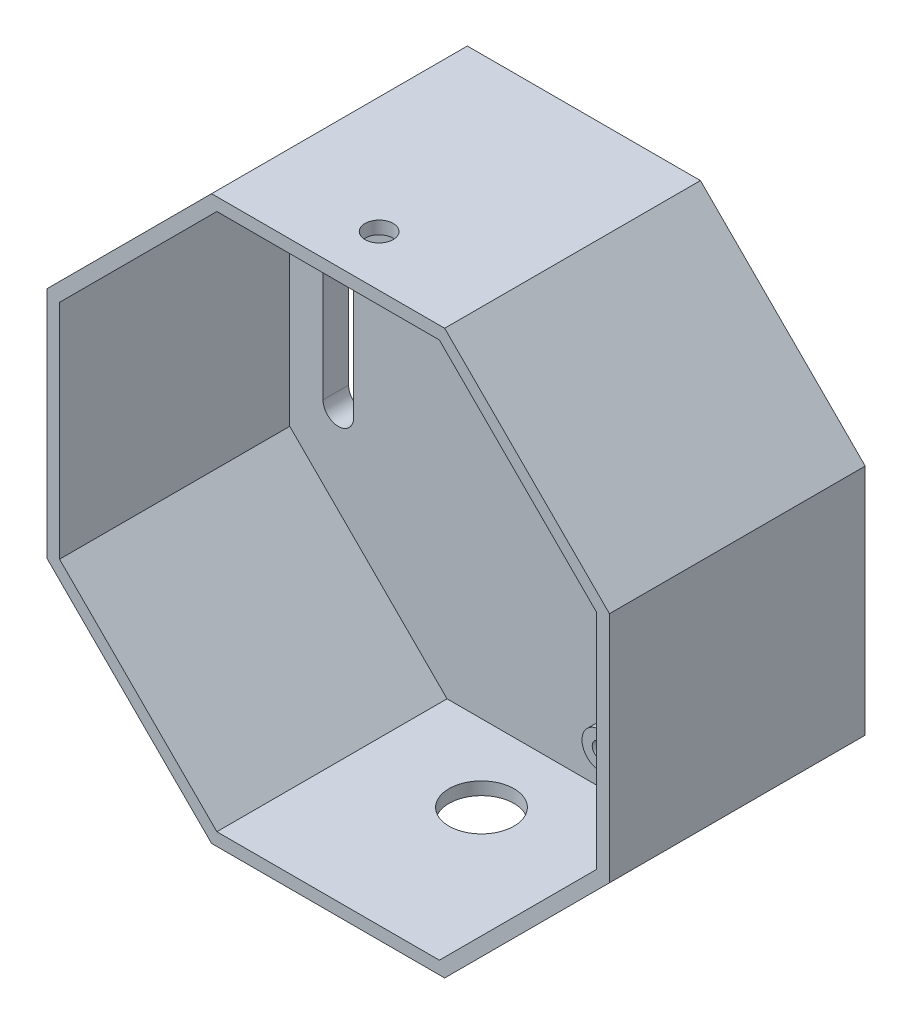
ISO-10303-21;
HEADER;
FILE_DESCRIPTION(('STEP AP214'),'2;1');
FILE_NAME('part.step','',(''),(''),'','','');
FILE_SCHEMA(('AUTOMOTIVE_DESIGN { 1 0 10303 214 1 1 1 1 }'));
ENDSEC;
DATA;
#1=APPLICATION_CONTEXT('core data for automotive mechanical design processes');
#2=APPLICATION_PROTOCOL_DEFINITION('international standard','automotive_design',2000,#1);
#3=PRODUCT_CONTEXT('',#1,'mechanical');
#4=PRODUCT('Part','Part','',(#3));
#5=PRODUCT_RELATED_PRODUCT_CATEGORY('part','',(#4));
#6=PRODUCT_DEFINITION_FORMATION('','',#4);
#7=PRODUCT_DEFINITION_CONTEXT('part definition',#1,'design');
#8=PRODUCT_DEFINITION('design','',#6,#7);
#9=PRODUCT_DEFINITION_SHAPE('','',#8);
#10=(LENGTH_UNIT() NAMED_UNIT(*) SI_UNIT(.MILLI.,.METRE.));
#11=(NAMED_UNIT(*) PLANE_ANGLE_UNIT() SI_UNIT($,.RADIAN.));
#12=(NAMED_UNIT(*) SI_UNIT($,.STERADIAN.) SOLID_ANGLE_UNIT());
#13=UNCERTAINTY_MEASURE_WITH_UNIT(LENGTH_MEASURE(1.E-05),#10,'distance_accuracy_value','');
#14=(GEOMETRIC_REPRESENTATION_CONTEXT(3) GLOBAL_UNCERTAINTY_ASSIGNED_CONTEXT((#13)) GLOBAL_UNIT_ASSIGNED_CONTEXT((#10,
#11,#12)) REPRESENTATION_CONTEXT('',''));
#15=CARTESIAN_POINT('',(0.,0.,0.));
#16=DIRECTION('',(0.,0.,1.));
#17=DIRECTION('',(1.,0.,0.));
#18=AXIS2_PLACEMENT_3D('',#15,#16,#17);
#19=CARTESIAN_POINT('',(55.0000000000001,-22.7817459305202,50.));
#20=DIRECTION('',(-1.,0.,0.));
#21=DIRECTION('',(0.,-1.,0.));
#22=AXIS2_PLACEMENT_3D('',#19,#20,#21);
#23=PLANE('',#22);
#24=DIRECTION('',(0.,1.,0.));
#25=VECTOR('',#24,1.);
#26=CARTESIAN_POINT('',(55.0000000000001,-22.7817459305202,0.));
#27=LINE('',#26,#25);
#28=CARTESIAN_POINT('',(55.0000000000001,-22.7817459305202,0.));
#29=VERTEX_POINT('',#28);
#30=CARTESIAN_POINT('',(55.,22.7817459305203,0.));
#31=VERTEX_POINT('',#30);
#32=EDGE_CURVE('E366',#29,#31,#27,.T.);
#33=ORIENTED_EDGE('',*,*,#32,.T.);
#34=DIRECTION('',(0.,0.,-1.));
#35=VECTOR('',#34,1.);
#36=CARTESIAN_POINT('',(55.,22.7817459305203,50.));
#37=LINE('',#36,#35);
#38=CARTESIAN_POINT('',(55.,22.7817459305203,50.));
#39=VERTEX_POINT('',#38);
#40=EDGE_CURVE('E472',#39,#31,#37,.T.);
#41=ORIENTED_EDGE('',*,*,#40,.F.);
#42=DIRECTION('',(0.,1.,0.));
#43=VECTOR('',#42,1.);
#44=CARTESIAN_POINT('',(55.0000000000001,-22.7817459305202,50.));
#45=LINE('',#44,#43);
#46=CARTESIAN_POINT('',(55.0000000000001,-22.7817459305202,50.));
#47=VERTEX_POINT('',#46);
#48=EDGE_CURVE('E357',#47,#39,#45,.T.);
#49=ORIENTED_EDGE('',*,*,#48,.F.);
#50=DIRECTION('',(0.,0.,-1.));
#51=VECTOR('',#50,1.);
#52=CARTESIAN_POINT('',(55.0000000000001,-22.7817459305202,50.));
#53=LINE('',#52,#51);
#54=EDGE_CURVE('E514',#47,#29,#53,.T.);
#55=ORIENTED_EDGE('',*,*,#54,.T.);
#56=EDGE_LOOP('',(#33,#41,#49,#55));
#57=FACE_BOUND('',#56,.T.);
#58=ADVANCED_FACE('F49',(#57),#23,.F.);
#59=CARTESIAN_POINT('',(55.,22.7817459305203,50.));
#60=DIRECTION('',(-0.707106781186547,-0.707106781186548,0.));
#61=DIRECTION('',(0.707106781186548,-0.707106781186547,0.));
#62=AXIS2_PLACEMENT_3D('',#59,#60,#61);
#63=PLANE('',#62);
#64=DIRECTION('',(-0.707106781186548,0.707106781186547,0.));
#65=VECTOR('',#64,1.);
#66=CARTESIAN_POINT('',(55.,22.7817459305203,0.));
#67=LINE('',#66,#65);
#68=CARTESIAN_POINT('',(22.7817459305202,55.0000000000001,0.));
#69=VERTEX_POINT('',#68);
#70=EDGE_CURVE('E443',#31,#69,#67,.T.);
#71=ORIENTED_EDGE('',*,*,#70,.T.);
#72=DIRECTION('',(0.,0.,-1.));
#73=VECTOR('',#72,1.);
#74=CARTESIAN_POINT('',(22.7817459305202,55.0000000000001,50.));
#75=LINE('',#74,#73);
#76=CARTESIAN_POINT('',(22.7817459305202,55.0000000000001,50.));
#77=VERTEX_POINT('',#76);
#78=EDGE_CURVE('E469',#77,#69,#75,.T.);
#79=ORIENTED_EDGE('',*,*,#78,.F.);
#80=DIRECTION('',(-0.707106781186548,0.707106781186547,0.));
#81=VECTOR('',#80,1.);
#82=CARTESIAN_POINT('',(55.,22.7817459305203,50.));
#83=LINE('',#82,#81);
#84=EDGE_CURVE('E478',#39,#77,#83,.T.);
#85=ORIENTED_EDGE('',*,*,#84,.F.);
#86=ORIENTED_EDGE('',*,*,#40,.T.);
#87=EDGE_LOOP('',(#71,#79,#85,#86));
#88=FACE_BOUND('',#87,.T.);
#89=ADVANCED_FACE('F558',(#88),#63,.F.);
#90=CARTESIAN_POINT('',(22.7817459305202,55.0000000000001,50.));
#91=DIRECTION('',(0.,-1.,0.));
#92=DIRECTION('',(1.,0.,0.));
#93=AXIS2_PLACEMENT_3D('',#90,#91,#92);
#94=PLANE('',#93);
#95=CARTESIAN_POINT('',(-1.00511830624085E-13,55.0000000000001,40.0311117273229));
#96=DIRECTION('',(0.,1.,0.));
#97=DIRECTION('',(0.,0.,1.));
#98=AXIS2_PLACEMENT_3D('',#95,#96,#97);
#99=CIRCLE('',#98,2.75000000000001);
#100=CARTESIAN_POINT('',(-1.00511830624085E-13,55.0000000000001,42.7811117273229));
#101=VERTEX_POINT('',#100);
#102=EDGE_CURVE('E423',#101,#101,#99,.T.);
#103=ORIENTED_EDGE('',*,*,#102,.F.);
#104=EDGE_LOOP('',(#103));
#105=FACE_BOUND('',#104,.T.);
#106=DIRECTION('',(-1.,0.,0.));
#107=VECTOR('',#106,1.);
#108=CARTESIAN_POINT('',(22.7817459305202,55.0000000000001,0.));
#109=LINE('',#108,#107);
#110=CARTESIAN_POINT('',(-22.7817459305204,55.,0.));
#111=VERTEX_POINT('',#110);
#112=EDGE_CURVE('E438',#69,#111,#109,.T.);
#113=ORIENTED_EDGE('',*,*,#112,.T.);
#114=DIRECTION('',(0.,0.,-1.));
#115=VECTOR('',#114,1.);
#116=CARTESIAN_POINT('',(-22.7817459305204,55.,50.));
#117=LINE('',#116,#115);
#118=CARTESIAN_POINT('',(-22.7817459305204,55.,50.));
#119=VERTEX_POINT('',#118);
#120=EDGE_CURVE('E462',#119,#111,#117,.T.);
#121=ORIENTED_EDGE('',*,*,#120,.F.);
#122=DIRECTION('',(-1.,0.,0.));
#123=VECTOR('',#122,1.);
#124=CARTESIAN_POINT('',(22.7817459305202,55.0000000000001,50.));
#125=LINE('',#124,#123);
#126=EDGE_CURVE('E480',#77,#119,#125,.T.);
#127=ORIENTED_EDGE('',*,*,#126,.F.);
#128=ORIENTED_EDGE('',*,*,#78,.T.);
#129=EDGE_LOOP('',(#113,#121,#127,#128));
#130=FACE_BOUND('',#129,.T.);
#131=ADVANCED_FACE('F562',(#105,#130),#94,.F.);
#132=CARTESIAN_POINT('',(-22.7817459305204,55.,50.));
#133=DIRECTION('',(0.707106781186549,-0.707106781186546,0.));
#134=DIRECTION('',(0.707106781186546,0.707106781186549,0.));
#135=AXIS2_PLACEMENT_3D('',#132,#133,#134);
#136=PLANE('',#135);
#137=DIRECTION('',(-0.707106781186546,-0.707106781186549,0.));
#138=VECTOR('',#137,1.);
#139=CARTESIAN_POINT('',(-22.7817459305204,55.,0.));
#140=LINE('',#139,#138);
#141=CARTESIAN_POINT('',(-55.0000000000001,22.7817459305202,0.));
#142=VERTEX_POINT('',#141);
#143=EDGE_CURVE('E442',#111,#142,#140,.T.);
#144=ORIENTED_EDGE('',*,*,#143,.T.);
#145=DIRECTION('',(0.,0.,-1.));
#146=VECTOR('',#145,1.);
#147=CARTESIAN_POINT('',(-55.0000000000001,22.7817459305202,50.));
#148=LINE('',#147,#146);
#149=CARTESIAN_POINT('',(-55.0000000000001,22.7817459305202,50.));
#150=VERTEX_POINT('',#149);
#151=EDGE_CURVE('E458',#150,#142,#148,.T.);
#152=ORIENTED_EDGE('',*,*,#151,.F.);
#153=DIRECTION('',(-0.707106781186546,-0.707106781186549,0.));
#154=VECTOR('',#153,1.);
#155=CARTESIAN_POINT('',(-22.7817459305204,55.,50.));
#156=LINE('',#155,#154);
#157=EDGE_CURVE('E482',#119,#150,#156,.T.);
#158=ORIENTED_EDGE('',*,*,#157,.F.);
#159=ORIENTED_EDGE('',*,*,#120,.T.);
#160=EDGE_LOOP('',(#144,#152,#158,#159));
#161=FACE_BOUND('',#160,.T.);
#162=ADVANCED_FACE('F566',(#161),#136,.F.);
#163=CARTESIAN_POINT('',(-55.0000000000001,22.7817459305202,50.));
#164=DIRECTION('',(1.,0.,0.));
#165=DIRECTION('',(0.,1.,0.));
#166=AXIS2_PLACEMENT_3D('',#163,#164,#165);
#167=PLANE('',#166);
#168=DIRECTION('',(0.,-1.,0.));
#169=VECTOR('',#168,1.);
#170=CARTESIAN_POINT('',(-55.0000000000001,22.7817459305202,0.));
#171=LINE('',#170,#169);
#172=CARTESIAN_POINT('',(-55.,-22.7817459305204,0.));
#173=VERTEX_POINT('',#172);
#174=EDGE_CURVE('E448',#142,#173,#171,.T.);
#175=ORIENTED_EDGE('',*,*,#174,.T.);
#176=DIRECTION('',(0.,0.,-1.));
#177=VECTOR('',#176,1.);
#178=CARTESIAN_POINT('',(-55.,-22.7817459305204,50.));
#179=LINE('',#178,#177);
#180=CARTESIAN_POINT('',(-55.,-22.7817459305204,50.));
#181=VERTEX_POINT('',#180);
#182=EDGE_CURVE('E463',#181,#173,#179,.T.);
#183=ORIENTED_EDGE('',*,*,#182,.F.);
#184=DIRECTION('',(0.,-1.,0.));
#185=VECTOR('',#184,1.);
#186=CARTESIAN_POINT('',(-55.0000000000001,22.7817459305202,50.));
#187=LINE('',#186,#185);
#188=EDGE_CURVE('E485',#150,#181,#187,.T.);
#189=ORIENTED_EDGE('',*,*,#188,.F.);
#190=ORIENTED_EDGE('',*,*,#151,.T.);
#191=EDGE_LOOP('',(#175,#183,#189,#190));
#192=FACE_BOUND('',#191,.T.);
#193=ADVANCED_FACE('F568',(#192),#167,.F.);
#194=CARTESIAN_POINT('',(-55.,-22.7817459305204,50.));
#195=DIRECTION('',(0.707106781186547,0.707106781186549,0.));
#196=DIRECTION('',(-0.707106781186549,0.707106781186547,0.));
#197=AXIS2_PLACEMENT_3D('',#194,#195,#196);
#198=PLANE('',#197);
#199=DIRECTION('',(0.707106781186549,-0.707106781186546,0.));
#200=VECTOR('',#199,1.);
#201=CARTESIAN_POINT('',(-55.,-22.7817459305204,0.));
#202=LINE('',#201,#200);
#203=CARTESIAN_POINT('',(-22.7817459305202,-55.0000000000001,0.));
#204=VERTEX_POINT('',#203);
#205=EDGE_CURVE('E496',#173,#204,#202,.T.);
#206=ORIENTED_EDGE('',*,*,#205,.T.);
#207=DIRECTION('',(0.,0.,-1.));
#208=VECTOR('',#207,1.);
#209=CARTESIAN_POINT('',(-22.7817459305202,-55.0000000000001,50.));
#210=LINE('',#209,#208);
#211=CARTESIAN_POINT('',(-22.7817459305202,-55.0000000000001,50.));
#212=VERTEX_POINT('',#211);
#213=EDGE_CURVE('E513',#212,#204,#210,.T.);
#214=ORIENTED_EDGE('',*,*,#213,.F.);
#215=DIRECTION('',(0.707106781186549,-0.707106781186546,0.));
#216=VECTOR('',#215,1.);
#217=CARTESIAN_POINT('',(-55.,-22.7817459305204,50.));
#218=LINE('',#217,#216);
#219=EDGE_CURVE('E488',#181,#212,#218,.T.);
#220=ORIENTED_EDGE('',*,*,#219,.F.);
#221=ORIENTED_EDGE('',*,*,#182,.T.);
#222=EDGE_LOOP('',(#206,#214,#220,#221));
#223=FACE_BOUND('',#222,.T.);
#224=ADVANCED_FACE('F527',(#223),#198,.F.);
#225=CARTESIAN_POINT('',(-22.7817459305202,-55.0000000000001,50.));
#226=DIRECTION('',(0.,1.,0.));
#227=DIRECTION('',(-1.,0.,0.));
#228=AXIS2_PLACEMENT_3D('',#225,#226,#227);
#229=PLANE('',#228);
#230=CARTESIAN_POINT('',(0.,-55.0000000000001,20.0175248097878));
#231=DIRECTION('',(0.,1.,0.));
#232=DIRECTION('',(0.,0.,1.));
#233=AXIS2_PLACEMENT_3D('',#230,#231,#232);
#234=CIRCLE('',#233,6.35000000000001);
#235=CARTESIAN_POINT('',(0.,-55.0000000000001,26.3675248097878));
#236=VERTEX_POINT('',#235);
#237=EDGE_CURVE('E322',#236,#236,#234,.T.);
#238=ORIENTED_EDGE('',*,*,#237,.T.);
#239=EDGE_LOOP('',(#238));
#240=FACE_BOUND('',#239,.T.);
#241=DIRECTION('',(1.,0.,0.));
#242=VECTOR('',#241,1.);
#243=CARTESIAN_POINT('',(-22.7817459305202,-55.0000000000001,0.));
#244=LINE('',#243,#242);
#245=CARTESIAN_POINT('',(22.7817459305204,-55.,0.));
#246=VERTEX_POINT('',#245);
#247=EDGE_CURVE('E499',#204,#246,#244,.T.);
#248=ORIENTED_EDGE('',*,*,#247,.T.);
#249=DIRECTION('',(0.,0.,-1.));
#250=VECTOR('',#249,1.);
#251=CARTESIAN_POINT('',(22.7817459305204,-55.,50.));
#252=LINE('',#251,#250);
#253=CARTESIAN_POINT('',(22.7817459305204,-55.,50.));
#254=VERTEX_POINT('',#253);
#255=EDGE_CURVE('E510',#254,#246,#252,.T.);
#256=ORIENTED_EDGE('',*,*,#255,.F.);
#257=DIRECTION('',(1.,0.,0.));
#258=VECTOR('',#257,1.);
#259=CARTESIAN_POINT('',(-22.7817459305202,-55.0000000000001,50.));
#260=LINE('',#259,#258);
#261=EDGE_CURVE('E547',#212,#254,#260,.T.);
#262=ORIENTED_EDGE('',*,*,#261,.F.);
#263=ORIENTED_EDGE('',*,*,#213,.T.);
#264=EDGE_LOOP('',(#248,#256,#262,#263));
#265=FACE_BOUND('',#264,.T.);
#266=ADVANCED_FACE('F537',(#240,#265),#229,.F.);
#267=CARTESIAN_POINT('',(22.7817459305204,-55.,50.));
#268=DIRECTION('',(-0.707106781186548,0.707106781186547,0.));
#269=DIRECTION('',(-0.707106781186547,-0.707106781186548,0.));
#270=AXIS2_PLACEMENT_3D('',#267,#268,#269);
#271=PLANE('',#270);
#272=DIRECTION('',(0.707106781186547,0.707106781186548,0.));
#273=VECTOR('',#272,1.);
#274=CARTESIAN_POINT('',(22.7817459305204,-55.,0.));
#275=LINE('',#274,#273);
#276=EDGE_CURVE('E502',#246,#29,#275,.T.);
#277=ORIENTED_EDGE('',*,*,#276,.T.);
#278=ORIENTED_EDGE('',*,*,#54,.F.);
#279=DIRECTION('',(0.707106781186547,0.707106781186548,0.));
#280=VECTOR('',#279,1.);
#281=CARTESIAN_POINT('',(22.7817459305204,-55.,50.));
#282=LINE('',#281,#280);
#283=EDGE_CURVE('E543',#254,#47,#282,.T.);
#284=ORIENTED_EDGE('',*,*,#283,.F.);
#285=ORIENTED_EDGE('',*,*,#255,.T.);
#286=EDGE_LOOP('',(#277,#278,#284,#285));
#287=FACE_BOUND('',#286,.T.);
#288=ADVANCED_FACE('F540',(#287),#271,.F.);
#289=CARTESIAN_POINT('',(0.,0.,50.));
#290=DIRECTION('',(0.,0.,1.));
#291=DIRECTION('',(1.,0.,0.));
#292=AXIS2_PLACEMENT_3D('',#289,#290,#291);
#293=PLANE('',#292);
#294=DIRECTION('',(0.,1.,0.));
#295=VECTOR('',#294,1.);
#296=CARTESIAN_POINT('',(52.5,-21.7462120245875,50.));
#297=LINE('',#296,#295);
#298=CARTESIAN_POINT('',(52.5,-21.7462120245875,50.));
#299=VERTEX_POINT('',#298);
#300=CARTESIAN_POINT('',(52.5,21.7462120245875,50.));
#301=VERTEX_POINT('',#300);
#302=EDGE_CURVE('E402',#299,#301,#297,.T.);
#303=ORIENTED_EDGE('',*,*,#302,.F.);
#304=DIRECTION('',(0.707106781186548,0.707106781186547,0.));
#305=VECTOR('',#304,1.);
#306=CARTESIAN_POINT('',(21.7462120245875,-52.5,50.));
#307=LINE('',#306,#305);
#308=CARTESIAN_POINT('',(21.7462120245875,-52.5,50.));
#309=VERTEX_POINT('',#308);
#310=EDGE_CURVE('E367',#309,#299,#307,.T.);
#311=ORIENTED_EDGE('',*,*,#310,.F.);
#312=DIRECTION('',(1.,0.,0.));
#313=VECTOR('',#312,1.);
#314=CARTESIAN_POINT('',(-21.7462120245875,-52.5,50.));
#315=LINE('',#314,#313);
#316=CARTESIAN_POINT('',(-21.7462120245875,-52.5,50.));
#317=VERTEX_POINT('',#316);
#318=EDGE_CURVE('E372',#317,#309,#315,.T.);
#319=ORIENTED_EDGE('',*,*,#318,.F.);
#320=DIRECTION('',(0.707106781186548,-0.707106781186547,0.));
#321=VECTOR('',#320,1.);
#322=CARTESIAN_POINT('',(-52.5,-21.7462120245875,50.));
#323=LINE('',#322,#321);
#324=CARTESIAN_POINT('',(-52.5,-21.7462120245875,50.));
#325=VERTEX_POINT('',#324);
#326=EDGE_CURVE('E384',#325,#317,#323,.T.);
#327=ORIENTED_EDGE('',*,*,#326,.F.);
#328=DIRECTION('',(0.,-1.,0.));
#329=VECTOR('',#328,1.);
#330=CARTESIAN_POINT('',(-52.5,21.7462120245875,50.));
#331=LINE('',#330,#329);
#332=CARTESIAN_POINT('',(-52.5,21.7462120245875,50.));
#333=VERTEX_POINT('',#332);
#334=EDGE_CURVE('E387',#333,#325,#331,.T.);
#335=ORIENTED_EDGE('',*,*,#334,.F.);
#336=DIRECTION('',(-0.707106781186547,-0.707106781186548,0.));
#337=VECTOR('',#336,1.);
#338=CARTESIAN_POINT('',(-21.7462120245875,52.5,50.));
#339=LINE('',#338,#337);
#340=CARTESIAN_POINT('',(-21.7462120245875,52.5,50.));
#341=VERTEX_POINT('',#340);
#342=EDGE_CURVE('E391',#341,#333,#339,.T.);
#343=ORIENTED_EDGE('',*,*,#342,.F.);
#344=DIRECTION('',(-1.,0.,0.));
#345=VECTOR('',#344,1.);
#346=CARTESIAN_POINT('',(21.7462120245875,52.5,50.));
#347=LINE('',#346,#345);
#348=CARTESIAN_POINT('',(21.7462120245875,52.5,50.));
#349=VERTEX_POINT('',#348);
#350=EDGE_CURVE('E395',#349,#341,#347,.T.);
#351=ORIENTED_EDGE('',*,*,#350,.F.);
#352=DIRECTION('',(-0.707106781186547,0.707106781186547,0.));
#353=VECTOR('',#352,1.);
#354=CARTESIAN_POINT('',(52.5,21.7462120245875,50.));
#355=LINE('',#354,#353);
#356=EDGE_CURVE('E399',#301,#349,#355,.T.);
#357=ORIENTED_EDGE('',*,*,#356,.F.);
#358=EDGE_LOOP('',(#303,#311,#319,#327,#335,#343,#351,#357));
#359=FACE_BOUND('',#358,.T.);
#360=ORIENTED_EDGE('',*,*,#48,.T.);
#361=ORIENTED_EDGE('',*,*,#84,.T.);
#362=ORIENTED_EDGE('',*,*,#126,.T.);
#363=ORIENTED_EDGE('',*,*,#157,.T.);
#364=ORIENTED_EDGE('',*,*,#188,.T.);
#365=ORIENTED_EDGE('',*,*,#219,.T.);
#366=ORIENTED_EDGE('',*,*,#261,.T.);
#367=ORIENTED_EDGE('',*,*,#283,.T.);
#368=EDGE_LOOP('',(#360,#361,#362,#363,#364,#365,#366,#367));
#369=FACE_BOUND('',#368,.T.);
#370=ADVANCED_FACE('F569',(#359,#369),#293,.T.);
#371=CARTESIAN_POINT('',(0.,0.,0.));
#372=DIRECTION('',(0.,0.,1.));
#373=DIRECTION('',(1.,0.,0.));
#374=AXIS2_PLACEMENT_3D('',#371,#372,#373);
#375=PLANE('',#374);
#376=DIRECTION('',(0.,-1.,0.));
#377=VECTOR('',#376,1.);
#378=CARTESIAN_POINT('',(-40.,12.9851643392364,0.));
#379=LINE('',#378,#377);
#380=CARTESIAN_POINT('',(-40.,12.9851643392364,0.));
#381=VERTEX_POINT('',#380);
#382=CARTESIAN_POINT('',(-40.,-14.0148356607636,0.));
#383=VERTEX_POINT('',#382);
#384=EDGE_CURVE('E253',#381,#383,#379,.T.);
#385=ORIENTED_EDGE('',*,*,#384,.F.);
#386=CARTESIAN_POINT('',(-43.,12.9851643392364,0.));
#387=DIRECTION('',(0.,0.,-1.));
#388=DIRECTION('',(-1.,0.,0.));
#389=AXIS2_PLACEMENT_3D('',#386,#387,#388);
#390=CIRCLE('',#389,3.00000000000001);
#391=CARTESIAN_POINT('',(-46.,12.9851643392364,0.));
#392=VERTEX_POINT('',#391);
#393=EDGE_CURVE('E64',#392,#381,#390,.T.);
#394=ORIENTED_EDGE('',*,*,#393,.F.);
#395=DIRECTION('',(0.,1.,0.));
#396=VECTOR('',#395,1.);
#397=CARTESIAN_POINT('',(-46.,12.9851643392364,0.));
#398=LINE('',#397,#396);
#399=CARTESIAN_POINT('',(-46.,-14.0148356607636,0.));
#400=VERTEX_POINT('',#399);
#401=EDGE_CURVE('E228',#400,#392,#398,.T.);
#402=ORIENTED_EDGE('',*,*,#401,.F.);
#403=CARTESIAN_POINT('',(-43.,-14.0148356607636,0.));
#404=DIRECTION('',(0.,0.,-1.));
#405=DIRECTION('',(-1.,0.,0.));
#406=AXIS2_PLACEMENT_3D('',#403,#404,#405);
#407=CIRCLE('',#406,3.);
#408=EDGE_CURVE('E231',#383,#400,#407,.T.);
#409=ORIENTED_EDGE('',*,*,#408,.F.);
#410=EDGE_LOOP('',(#385,#394,#402,#409));
#411=FACE_BOUND('',#410,.T.);
#412=DIRECTION('',(0.,1.,0.));
#413=VECTOR('',#412,1.);
#414=CARTESIAN_POINT('',(46.,13.2597000379349,0.));
#415=LINE('',#414,#413);
#416=CARTESIAN_POINT('',(46.,13.2597000379349,0.));
#417=VERTEX_POINT('',#416);
#418=CARTESIAN_POINT('',(46.,-13.2906595236504,0.));
#419=VERTEX_POINT('',#418);
#420=EDGE_CURVE('E315',#417,#419,#415,.F.);
#421=ORIENTED_EDGE('',*,*,#420,.F.);
#422=CARTESIAN_POINT('',(43.,13.2597000379349,0.));
#423=DIRECTION('',(0.,0.,-1.));
#424=DIRECTION('',(-1.,0.,0.));
#425=AXIS2_PLACEMENT_3D('',#422,#423,#424);
#426=CIRCLE('',#425,2.99999999999999);
#427=CARTESIAN_POINT('',(40.,13.2597000379349,0.));
#428=VERTEX_POINT('',#427);
#429=EDGE_CURVE('E323',#428,#417,#426,.T.);
#430=ORIENTED_EDGE('',*,*,#429,.F.);
#431=DIRECTION('',(0.,-1.,0.));
#432=VECTOR('',#431,1.);
#433=CARTESIAN_POINT('',(40.,13.2597000379349,0.));
#434=LINE('',#433,#432);
#435=CARTESIAN_POINT('',(40.,-13.2906595236504,0.));
#436=VERTEX_POINT('',#435);
#437=EDGE_CURVE('E578',#436,#428,#434,.F.);
#438=ORIENTED_EDGE('',*,*,#437,.F.);
#439=CARTESIAN_POINT('',(43.,-13.2906595236504,0.));
#440=DIRECTION('',(0.,0.,-1.));
#441=DIRECTION('',(-1.,0.,0.));
#442=AXIS2_PLACEMENT_3D('',#439,#440,#441);
#443=CIRCLE('',#442,2.99999999999999);
#444=EDGE_CURVE('E579',#419,#436,#443,.T.);
#445=ORIENTED_EDGE('',*,*,#444,.F.);
#446=EDGE_LOOP('',(#421,#430,#438,#445));
#447=FACE_BOUND('',#446,.T.);
#448=ORIENTED_EDGE('',*,*,#32,.F.);
#449=ORIENTED_EDGE('',*,*,#276,.F.);
#450=ORIENTED_EDGE('',*,*,#247,.F.);
#451=ORIENTED_EDGE('',*,*,#205,.F.);
#452=ORIENTED_EDGE('',*,*,#174,.F.);
#453=ORIENTED_EDGE('',*,*,#143,.F.);
#454=ORIENTED_EDGE('',*,*,#112,.F.);
#455=ORIENTED_EDGE('',*,*,#70,.F.);
#456=EDGE_LOOP('',(#448,#449,#450,#451,#452,#453,#454,#455));
#457=FACE_BOUND('',#456,.T.);
#458=ADVANCED_FACE('F533',(#411,#447,#457),#375,.F.);
#459=CARTESIAN_POINT('',(52.5,-21.7462120245875,5.));
#460=DIRECTION('',(1.,0.,0.));
#461=DIRECTION('',(0.,0.,-1.));
#462=AXIS2_PLACEMENT_3D('',#459,#460,#461);
#463=PLANE('',#462);
#464=ORIENTED_EDGE('',*,*,#302,.T.);
#465=DIRECTION('',(0.,0.,1.));
#466=VECTOR('',#465,1.);
#467=CARTESIAN_POINT('',(52.5,21.7462120245875,5.));
#468=LINE('',#467,#466);
#469=CARTESIAN_POINT('',(52.5,21.7462120245875,5.));
#470=VERTEX_POINT('',#469);
#471=EDGE_CURVE('E352',#470,#301,#468,.T.);
#472=ORIENTED_EDGE('',*,*,#471,.F.);
#473=DIRECTION('',(0.,1.,0.));
#474=VECTOR('',#473,1.);
#475=CARTESIAN_POINT('',(52.5,-21.7462120245875,5.));
#476=LINE('',#475,#474);
#477=CARTESIAN_POINT('',(52.5,-21.7462120245875,5.));
#478=VERTEX_POINT('',#477);
#479=EDGE_CURVE('E371',#478,#470,#476,.T.);
#480=ORIENTED_EDGE('',*,*,#479,.F.);
#481=DIRECTION('',(0.,0.,1.));
#482=VECTOR('',#481,1.);
#483=CARTESIAN_POINT('',(52.5,-21.7462120245875,5.));
#484=LINE('',#483,#482);
#485=EDGE_CURVE('E363',#478,#299,#484,.T.);
#486=ORIENTED_EDGE('',*,*,#485,.T.);
#487=EDGE_LOOP('',(#464,#472,#480,#486));
#488=FACE_BOUND('',#487,.T.);
#489=ADVANCED_FACE('F645',(#488),#463,.F.);
#490=CARTESIAN_POINT('',(21.7462120245875,-52.5,5.));
#491=DIRECTION('',(0.707106781186547,-0.707106781186547,0.));
#492=DIRECTION('',(0.707106781186548,0.707106781186548,0.));
#493=AXIS2_PLACEMENT_3D('',#490,#491,#492);
#494=PLANE('',#493);
#495=ORIENTED_EDGE('',*,*,#310,.T.);
#496=ORIENTED_EDGE('',*,*,#485,.F.);
#497=DIRECTION('',(0.707106781186548,0.707106781186547,0.));
#498=VECTOR('',#497,1.);
#499=CARTESIAN_POINT('',(21.7462120245875,-52.5,5.));
#500=LINE('',#499,#498);
#501=CARTESIAN_POINT('',(21.7462120245875,-52.5,5.));
#502=VERTEX_POINT('',#501);
#503=EDGE_CURVE('E356',#502,#478,#500,.T.);
#504=ORIENTED_EDGE('',*,*,#503,.F.);
#505=DIRECTION('',(0.,0.,1.));
#506=VECTOR('',#505,1.);
#507=CARTESIAN_POINT('',(21.7462120245875,-52.5,5.));
#508=LINE('',#507,#506);
#509=EDGE_CURVE('E337',#502,#309,#508,.T.);
#510=ORIENTED_EDGE('',*,*,#509,.T.);
#511=EDGE_LOOP('',(#495,#496,#504,#510));
#512=FACE_BOUND('',#511,.T.);
#513=ADVANCED_FACE('F641',(#512),#494,.F.);
#514=CARTESIAN_POINT('',(-21.7462120245875,-52.5,5.));
#515=DIRECTION('',(0.,-1.,0.));
#516=DIRECTION('',(0.,0.,-1.));
#517=AXIS2_PLACEMENT_3D('',#514,#515,#516);
#518=PLANE('',#517);
#519=CARTESIAN_POINT('',(0.,-52.5,20.0175248097878));
#520=DIRECTION('',(0.,1.,0.));
#521=DIRECTION('',(0.,0.,1.));
#522=AXIS2_PLACEMENT_3D('',#519,#520,#521);
#523=CIRCLE('',#522,6.35000000000001);
#524=CARTESIAN_POINT('',(0.,-52.5,26.3675248097878));
#525=VERTEX_POINT('',#524);
#526=EDGE_CURVE('E318',#525,#525,#523,.T.);
#527=ORIENTED_EDGE('',*,*,#526,.F.);
#528=EDGE_LOOP('',(#527));
#529=FACE_BOUND('',#528,.T.);
#530=ORIENTED_EDGE('',*,*,#318,.T.);
#531=ORIENTED_EDGE('',*,*,#509,.F.);
#532=DIRECTION('',(1.,0.,0.));
#533=VECTOR('',#532,1.);
#534=CARTESIAN_POINT('',(-21.7462120245875,-52.5,5.));
#535=LINE('',#534,#533);
#536=CARTESIAN_POINT('',(-21.7462120245875,-52.5,5.));
#537=VERTEX_POINT('',#536);
#538=EDGE_CURVE('E408',#537,#502,#535,.T.);
#539=ORIENTED_EDGE('',*,*,#538,.F.);
#540=DIRECTION('',(0.,0.,1.));
#541=VECTOR('',#540,1.);
#542=CARTESIAN_POINT('',(-21.7462120245875,-52.5,5.));
#543=LINE('',#542,#541);
#544=EDGE_CURVE('E335',#537,#317,#543,.T.);
#545=ORIENTED_EDGE('',*,*,#544,.T.);
#546=EDGE_LOOP('',(#530,#531,#539,#545));
#547=FACE_BOUND('',#546,.T.);
#548=ADVANCED_FACE('F666',(#529,#547),#518,.F.);
#549=CARTESIAN_POINT('',(-52.5,-21.7462120245875,5.));
#550=DIRECTION('',(-0.707106781186547,-0.707106781186547,0.));
#551=DIRECTION('',(0.707106781186548,-0.707106781186547,0.));
#552=AXIS2_PLACEMENT_3D('',#549,#550,#551);
#553=PLANE('',#552);
#554=ORIENTED_EDGE('',*,*,#326,.T.);
#555=ORIENTED_EDGE('',*,*,#544,.F.);
#556=DIRECTION('',(0.707106781186548,-0.707106781186547,0.));
#557=VECTOR('',#556,1.);
#558=CARTESIAN_POINT('',(-52.5,-21.7462120245875,5.));
#559=LINE('',#558,#557);
#560=CARTESIAN_POINT('',(-52.5,-21.7462120245875,5.));
#561=VERTEX_POINT('',#560);
#562=EDGE_CURVE('E634',#561,#537,#559,.T.);
#563=ORIENTED_EDGE('',*,*,#562,.F.);
#564=DIRECTION('',(0.,0.,1.));
#565=VECTOR('',#564,1.);
#566=CARTESIAN_POINT('',(-52.5,-21.7462120245875,5.));
#567=LINE('',#566,#565);
#568=EDGE_CURVE('E338',#561,#325,#567,.T.);
#569=ORIENTED_EDGE('',*,*,#568,.T.);
#570=EDGE_LOOP('',(#554,#555,#563,#569));
#571=FACE_BOUND('',#570,.T.);
#572=ADVANCED_FACE('F664',(#571),#553,.F.);
#573=CARTESIAN_POINT('',(-52.5,21.7462120245875,5.));
#574=DIRECTION('',(-1.,0.,0.));
#575=DIRECTION('',(0.,0.,1.));
#576=AXIS2_PLACEMENT_3D('',#573,#574,#575);
#577=PLANE('',#576);
#578=ORIENTED_EDGE('',*,*,#334,.T.);
#579=ORIENTED_EDGE('',*,*,#568,.F.);
#580=DIRECTION('',(0.,-1.,0.));
#581=VECTOR('',#580,1.);
#582=CARTESIAN_POINT('',(-52.5,21.7462120245875,5.));
#583=LINE('',#582,#581);
#584=CARTESIAN_POINT('',(-52.5,21.7462120245875,5.));
#585=VERTEX_POINT('',#584);
#586=EDGE_CURVE('E631',#585,#561,#583,.T.);
#587=ORIENTED_EDGE('',*,*,#586,.F.);
#588=DIRECTION('',(0.,0.,1.));
#589=VECTOR('',#588,1.);
#590=CARTESIAN_POINT('',(-52.5,21.7462120245875,5.));
#591=LINE('',#590,#589);
#592=EDGE_CURVE('E343',#585,#333,#591,.T.);
#593=ORIENTED_EDGE('',*,*,#592,.T.);
#594=EDGE_LOOP('',(#578,#579,#587,#593));
#595=FACE_BOUND('',#594,.T.);
#596=ADVANCED_FACE('F661',(#595),#577,.F.);
#597=CARTESIAN_POINT('',(-21.7462120245875,52.5,5.));
#598=DIRECTION('',(-0.707106781186548,0.707106781186547,0.));
#599=DIRECTION('',(-0.707106781186547,-0.707106781186548,0.));
#600=AXIS2_PLACEMENT_3D('',#597,#598,#599);
#601=PLANE('',#600);
#602=ORIENTED_EDGE('',*,*,#342,.T.);
#603=ORIENTED_EDGE('',*,*,#592,.F.);
#604=DIRECTION('',(-0.707106781186547,-0.707106781186548,0.));
#605=VECTOR('',#604,1.);
#606=CARTESIAN_POINT('',(-21.7462120245875,52.5,5.));
#607=LINE('',#606,#605);
#608=CARTESIAN_POINT('',(-21.7462120245875,52.5,5.));
#609=VERTEX_POINT('',#608);
#610=EDGE_CURVE('E627',#609,#585,#607,.T.);
#611=ORIENTED_EDGE('',*,*,#610,.F.);
#612=DIRECTION('',(0.,0.,1.));
#613=VECTOR('',#612,1.);
#614=CARTESIAN_POINT('',(-21.7462120245875,52.5,5.));
#615=LINE('',#614,#613);
#616=EDGE_CURVE('E346',#609,#341,#615,.T.);
#617=ORIENTED_EDGE('',*,*,#616,.T.);
#618=EDGE_LOOP('',(#602,#603,#611,#617));
#619=FACE_BOUND('',#618,.T.);
#620=ADVANCED_FACE('F659',(#619),#601,.F.);
#621=CARTESIAN_POINT('',(21.7462120245875,52.5,5.));
#622=DIRECTION('',(0.,1.,0.));
#623=DIRECTION('',(-1.,0.,0.));
#624=AXIS2_PLACEMENT_3D('',#621,#622,#623);
#625=PLANE('',#624);
#626=CARTESIAN_POINT('',(-1.00511830624085E-13,52.5,40.0311117273229));
#627=DIRECTION('',(0.,1.,0.));
#628=DIRECTION('',(-1.,0.,0.));
#629=AXIS2_PLACEMENT_3D('',#626,#627,#628);
#630=CIRCLE('',#629,2.75000000000001);
#631=CARTESIAN_POINT('',(-2.75000000000011,52.5,40.0311117273229));
#632=VERTEX_POINT('',#631);
#633=EDGE_CURVE('E235',#632,#632,#630,.T.);
#634=ORIENTED_EDGE('',*,*,#633,.T.);
#635=EDGE_LOOP('',(#634));
#636=FACE_BOUND('',#635,.T.);
#637=ORIENTED_EDGE('',*,*,#350,.T.);
#638=ORIENTED_EDGE('',*,*,#616,.F.);
#639=DIRECTION('',(-1.,0.,0.));
#640=VECTOR('',#639,1.);
#641=CARTESIAN_POINT('',(21.7462120245875,52.5,5.));
#642=LINE('',#641,#640);
#643=CARTESIAN_POINT('',(21.7462120245875,52.5,5.));
#644=VERTEX_POINT('',#643);
#645=EDGE_CURVE('E616',#644,#609,#642,.T.);
#646=ORIENTED_EDGE('',*,*,#645,.F.);
#647=DIRECTION('',(0.,0.,1.));
#648=VECTOR('',#647,1.);
#649=CARTESIAN_POINT('',(21.7462120245875,52.5,5.));
#650=LINE('',#649,#648);
#651=EDGE_CURVE('E349',#644,#349,#650,.T.);
#652=ORIENTED_EDGE('',*,*,#651,.T.);
#653=EDGE_LOOP('',(#637,#638,#646,#652));
#654=FACE_BOUND('',#653,.T.);
#655=ADVANCED_FACE('F654',(#636,#654),#625,.F.);
#656=CARTESIAN_POINT('',(52.5,21.7462120245875,5.));
#657=DIRECTION('',(0.707106781186547,0.707106781186547,0.));
#658=DIRECTION('',(-0.707106781186548,0.707106781186548,0.));
#659=AXIS2_PLACEMENT_3D('',#656,#657,#658);
#660=PLANE('',#659);
#661=ORIENTED_EDGE('',*,*,#356,.T.);
#662=ORIENTED_EDGE('',*,*,#651,.F.);
#663=DIRECTION('',(-0.707106781186547,0.707106781186547,0.));
#664=VECTOR('',#663,1.);
#665=CARTESIAN_POINT('',(52.5,21.7462120245875,5.));
#666=LINE('',#665,#664);
#667=EDGE_CURVE('E612',#470,#644,#666,.T.);
#668=ORIENTED_EDGE('',*,*,#667,.F.);
#669=ORIENTED_EDGE('',*,*,#471,.T.);
#670=EDGE_LOOP('',(#661,#662,#668,#669));
#671=FACE_BOUND('',#670,.T.);
#672=ADVANCED_FACE('F604',(#671),#660,.F.);
#673=CARTESIAN_POINT('',(0.,0.,5.));
#674=DIRECTION('',(0.,0.,1.));
#675=DIRECTION('',(1.,0.,0.));
#676=AXIS2_PLACEMENT_3D('',#673,#674,#675);
#677=PLANE('',#676);
#678=CARTESIAN_POINT('',(13.1313369494427,-41.2705770144938,5.));
#679=DIRECTION('',(0.,0.,1.));
#680=DIRECTION('',(1.,0.,0.));
#681=AXIS2_PLACEMENT_3D('',#678,#679,#680);
#682=CIRCLE('',#681,3.5);
#683=CARTESIAN_POINT('',(16.6313369494427,-41.2705770144938,5.));
#684=VERTEX_POINT('',#683);
#685=EDGE_CURVE('E12',#684,#684,#682,.T.);
#686=ORIENTED_EDGE('',*,*,#685,.F.);
#687=EDGE_LOOP('',(#686));
#688=FACE_BOUND('',#687,.T.);
#689=CARTESIAN_POINT('',(-15.2748214444034,17.4515306773664,5.));
#690=DIRECTION('',(0.,0.,1.));
#691=DIRECTION('',(1.,0.,0.));
#692=AXIS2_PLACEMENT_3D('',#689,#690,#691);
#693=CIRCLE('',#692,3.5);
#694=CARTESIAN_POINT('',(-11.7748214444034,17.4515306773664,5.));
#695=VERTEX_POINT('',#694);
#696=EDGE_CURVE('E57',#695,#695,#693,.T.);
#697=ORIENTED_EDGE('',*,*,#696,.F.);
#698=EDGE_LOOP('',(#697));
#699=FACE_BOUND('',#698,.T.);
#700=CARTESIAN_POINT('',(-43.,12.9851643392364,5.));
#701=DIRECTION('',(0.,0.,-1.));
#702=DIRECTION('',(-1.,0.,0.));
#703=AXIS2_PLACEMENT_3D('',#700,#701,#702);
#704=CIRCLE('',#703,3.00000000000001);
#705=CARTESIAN_POINT('',(-46.,12.9851643392364,5.));
#706=VERTEX_POINT('',#705);
#707=CARTESIAN_POINT('',(-40.,12.9851643392364,5.));
#708=VERTEX_POINT('',#707);
#709=EDGE_CURVE('E212',#706,#708,#704,.T.);
#710=ORIENTED_EDGE('',*,*,#709,.T.);
#711=DIRECTION('',(0.,-1.,0.));
#712=VECTOR('',#711,1.);
#713=CARTESIAN_POINT('',(-40.,12.9851643392364,5.));
#714=LINE('',#713,#712);
#715=CARTESIAN_POINT('',(-40.,-14.0148356607636,5.));
#716=VERTEX_POINT('',#715);
#717=EDGE_CURVE('E221',#708,#716,#714,.T.);
#718=ORIENTED_EDGE('',*,*,#717,.T.);
#719=CARTESIAN_POINT('',(-43.,-14.0148356607636,5.));
#720=DIRECTION('',(0.,0.,-1.));
#721=DIRECTION('',(-1.,0.,0.));
#722=AXIS2_PLACEMENT_3D('',#719,#720,#721);
#723=CIRCLE('',#722,3.);
#724=CARTESIAN_POINT('',(-46.,-14.0148356607636,5.));
#725=VERTEX_POINT('',#724);
#726=EDGE_CURVE('E72',#716,#725,#723,.T.);
#727=ORIENTED_EDGE('',*,*,#726,.T.);
#728=DIRECTION('',(0.,1.,0.));
#729=VECTOR('',#728,1.);
#730=CARTESIAN_POINT('',(-46.,12.9851643392364,5.));
#731=LINE('',#730,#729);
#732=EDGE_CURVE('E218',#725,#706,#731,.T.);
#733=ORIENTED_EDGE('',*,*,#732,.T.);
#734=EDGE_LOOP('',(#710,#718,#727,#733));
#735=FACE_BOUND('',#734,.T.);
#736=CARTESIAN_POINT('',(43.,13.2597000379349,5.));
#737=DIRECTION('',(0.,0.,-1.));
#738=DIRECTION('',(-1.,0.,0.));
#739=AXIS2_PLACEMENT_3D('',#736,#737,#738);
#740=CIRCLE('',#739,2.99999999999999);
#741=CARTESIAN_POINT('',(40.,13.2597000379349,5.));
#742=VERTEX_POINT('',#741);
#743=CARTESIAN_POINT('',(46.,13.2597000379349,5.));
#744=VERTEX_POINT('',#743);
#745=EDGE_CURVE('E268',#742,#744,#740,.T.);
#746=ORIENTED_EDGE('',*,*,#745,.T.);
#747=DIRECTION('',(0.,-1.,0.));
#748=VECTOR('',#747,1.);
#749=CARTESIAN_POINT('',(46.,13.2597000379349,5.));
#750=LINE('',#749,#748);
#751=CARTESIAN_POINT('',(46.,-13.2906595236504,5.));
#752=VERTEX_POINT('',#751);
#753=EDGE_CURVE('E285',#744,#752,#750,.T.);
#754=ORIENTED_EDGE('',*,*,#753,.T.);
#755=CARTESIAN_POINT('',(43.,-13.2906595236504,5.));
#756=DIRECTION('',(0.,0.,-1.));
#757=DIRECTION('',(-1.,0.,0.));
#758=AXIS2_PLACEMENT_3D('',#755,#756,#757);
#759=CIRCLE('',#758,2.99999999999999);
#760=CARTESIAN_POINT('',(40.,-13.2906595236504,5.));
#761=VERTEX_POINT('',#760);
#762=EDGE_CURVE('E293',#752,#761,#759,.T.);
#763=ORIENTED_EDGE('',*,*,#762,.T.);
#764=DIRECTION('',(0.,1.,0.));
#765=VECTOR('',#764,1.);
#766=CARTESIAN_POINT('',(40.,13.2597000379349,5.));
#767=LINE('',#766,#765);
#768=EDGE_CURVE('E296',#761,#742,#767,.T.);
#769=ORIENTED_EDGE('',*,*,#768,.T.);
#770=EDGE_LOOP('',(#746,#754,#763,#769));
#771=FACE_BOUND('',#770,.T.);
#772=ORIENTED_EDGE('',*,*,#479,.T.);
#773=ORIENTED_EDGE('',*,*,#667,.T.);
#774=ORIENTED_EDGE('',*,*,#645,.T.);
#775=ORIENTED_EDGE('',*,*,#610,.T.);
#776=ORIENTED_EDGE('',*,*,#586,.T.);
#777=ORIENTED_EDGE('',*,*,#562,.T.);
#778=ORIENTED_EDGE('',*,*,#538,.T.);
#779=ORIENTED_EDGE('',*,*,#503,.T.);
#780=EDGE_LOOP('',(#772,#773,#774,#775,#776,#777,#778,#779));
#781=FACE_BOUND('',#780,.T.);
#782=ADVANCED_FACE('F225',(#688,#699,#735,#771,#781),#677,.T.);
#783=CARTESIAN_POINT('',(0.,-52.5,20.0175248097878));
#784=DIRECTION('',(0.,1.,0.));
#785=DIRECTION('',(0.,0.,1.));
#786=AXIS2_PLACEMENT_3D('',#783,#784,#785);
#787=CYLINDRICAL_SURFACE('',#786,6.35000000000001);
#788=ORIENTED_EDGE('',*,*,#237,.F.);
#789=EDGE_LOOP('',(#788));
#790=FACE_BOUND('',#789,.T.);
#791=ORIENTED_EDGE('',*,*,#526,.T.);
#792=EDGE_LOOP('',(#791));
#793=FACE_BOUND('',#792,.T.);
#794=ADVANCED_FACE('F603',(#790,#793),#787,.F.);
#795=CARTESIAN_POINT('',(43.,13.2597000379349,5.));
#796=DIRECTION('',(0.,0.,-1.));
#797=DIRECTION('',(-1.,0.,0.));
#798=AXIS2_PLACEMENT_3D('',#795,#796,#797);
#799=CYLINDRICAL_SURFACE('',#798,2.99999999999999);
#800=DIRECTION('',(0.,0.,-1.));
#801=VECTOR('',#800,1.);
#802=CARTESIAN_POINT('',(46.,13.2597000379349,5.));
#803=LINE('',#802,#801);
#804=EDGE_CURVE('E300',#744,#417,#803,.T.);
#805=ORIENTED_EDGE('',*,*,#804,.F.);
#806=ORIENTED_EDGE('',*,*,#745,.F.);
#807=DIRECTION('',(0.,0.,-1.));
#808=VECTOR('',#807,1.);
#809=CARTESIAN_POINT('',(40.,13.2597000379349,5.));
#810=LINE('',#809,#808);
#811=EDGE_CURVE('E311',#742,#428,#810,.T.);
#812=ORIENTED_EDGE('',*,*,#811,.T.);
#813=ORIENTED_EDGE('',*,*,#429,.T.);
#814=EDGE_LOOP('',(#805,#806,#812,#813));
#815=FACE_BOUND('',#814,.T.);
#816=ADVANCED_FACE('F600',(#815),#799,.F.);
#817=CARTESIAN_POINT('',(40.,13.2597000379349,5.));
#818=DIRECTION('',(-1.,0.,0.));
#819=DIRECTION('',(0.,-1.,0.));
#820=AXIS2_PLACEMENT_3D('',#817,#818,#819);
#821=PLANE('',#820);
#822=ORIENTED_EDGE('',*,*,#811,.F.);
#823=ORIENTED_EDGE('',*,*,#768,.F.);
#824=DIRECTION('',(0.,0.,-1.));
#825=VECTOR('',#824,1.);
#826=CARTESIAN_POINT('',(40.,-13.2906595236504,5.));
#827=LINE('',#826,#825);
#828=EDGE_CURVE('E316',#761,#436,#827,.T.);
#829=ORIENTED_EDGE('',*,*,#828,.T.);
#830=ORIENTED_EDGE('',*,*,#437,.T.);
#831=EDGE_LOOP('',(#822,#823,#829,#830));
#832=FACE_BOUND('',#831,.T.);
#833=ADVANCED_FACE('F596',(#832),#821,.F.);
#834=CARTESIAN_POINT('',(43.,-13.2906595236504,5.));
#835=DIRECTION('',(0.,0.,-1.));
#836=DIRECTION('',(-1.,0.,0.));
#837=AXIS2_PLACEMENT_3D('',#834,#835,#836);
#838=CYLINDRICAL_SURFACE('',#837,2.99999999999999);
#839=ORIENTED_EDGE('',*,*,#828,.F.);
#840=ORIENTED_EDGE('',*,*,#762,.F.);
#841=DIRECTION('',(0.,0.,-1.));
#842=VECTOR('',#841,1.);
#843=CARTESIAN_POINT('',(46.,-13.2906595236504,5.));
#844=LINE('',#843,#842);
#845=EDGE_CURVE('E302',#752,#419,#844,.T.);
#846=ORIENTED_EDGE('',*,*,#845,.T.);
#847=ORIENTED_EDGE('',*,*,#444,.T.);
#848=EDGE_LOOP('',(#839,#840,#846,#847));
#849=FACE_BOUND('',#848,.T.);
#850=ADVANCED_FACE('F592',(#849),#838,.F.);
#851=CARTESIAN_POINT('',(46.,13.2597000379349,5.));
#852=DIRECTION('',(1.,0.,0.));
#853=DIRECTION('',(0.,1.,0.));
#854=AXIS2_PLACEMENT_3D('',#851,#852,#853);
#855=PLANE('',#854);
#856=ORIENTED_EDGE('',*,*,#845,.F.);
#857=ORIENTED_EDGE('',*,*,#753,.F.);
#858=ORIENTED_EDGE('',*,*,#804,.T.);
#859=ORIENTED_EDGE('',*,*,#420,.T.);
#860=EDGE_LOOP('',(#856,#857,#858,#859));
#861=FACE_BOUND('',#860,.T.);
#862=ADVANCED_FACE('F585',(#861),#855,.F.);
#863=CARTESIAN_POINT('',(-43.,12.9851643392364,5.));
#864=DIRECTION('',(0.,0.,-1.));
#865=DIRECTION('',(-1.,0.,0.));
#866=AXIS2_PLACEMENT_3D('',#863,#864,#865);
#867=CYLINDRICAL_SURFACE('',#866,3.00000000000001);
#868=ORIENTED_EDGE('',*,*,#393,.T.);
#869=DIRECTION('',(0.,0.,-1.));
#870=VECTOR('',#869,1.);
#871=CARTESIAN_POINT('',(-40.,12.9851643392364,5.));
#872=LINE('',#871,#870);
#873=EDGE_CURVE('E208',#708,#381,#872,.T.);
#874=ORIENTED_EDGE('',*,*,#873,.F.);
#875=ORIENTED_EDGE('',*,*,#709,.F.);
#876=DIRECTION('',(0.,0.,-1.));
#877=VECTOR('',#876,1.);
#878=CARTESIAN_POINT('',(-46.,12.9851643392364,5.));
#879=LINE('',#878,#877);
#880=EDGE_CURVE('E265',#706,#392,#879,.T.);
#881=ORIENTED_EDGE('',*,*,#880,.T.);
#882=EDGE_LOOP('',(#868,#874,#875,#881));
#883=FACE_BOUND('',#882,.T.);
#884=ADVANCED_FACE('F210',(#883),#867,.F.);
#885=CARTESIAN_POINT('',(-46.,12.9851643392364,5.));
#886=DIRECTION('',(-1.,0.,0.));
#887=DIRECTION('',(0.,-1.,0.));
#888=AXIS2_PLACEMENT_3D('',#885,#886,#887);
#889=PLANE('',#888);
#890=ORIENTED_EDGE('',*,*,#401,.T.);
#891=ORIENTED_EDGE('',*,*,#880,.F.);
#892=ORIENTED_EDGE('',*,*,#732,.F.);
#893=DIRECTION('',(0.,0.,-1.));
#894=VECTOR('',#893,1.);
#895=CARTESIAN_POINT('',(-46.,-14.0148356607636,5.));
#896=LINE('',#895,#894);
#897=EDGE_CURVE('E269',#725,#400,#896,.T.);
#898=ORIENTED_EDGE('',*,*,#897,.T.);
#899=EDGE_LOOP('',(#890,#891,#892,#898));
#900=FACE_BOUND('',#899,.T.);
#901=ADVANCED_FACE('F755',(#900),#889,.F.);
#902=CARTESIAN_POINT('',(-43.,-14.0148356607636,5.));
#903=DIRECTION('',(0.,0.,-1.));
#904=DIRECTION('',(-1.,0.,0.));
#905=AXIS2_PLACEMENT_3D('',#902,#903,#904);
#906=CYLINDRICAL_SURFACE('',#905,3.);
#907=ORIENTED_EDGE('',*,*,#408,.T.);
#908=ORIENTED_EDGE('',*,*,#897,.F.);
#909=ORIENTED_EDGE('',*,*,#726,.F.);
#910=DIRECTION('',(0.,0.,-1.));
#911=VECTOR('',#910,1.);
#912=CARTESIAN_POINT('',(-40.,-14.0148356607636,5.));
#913=LINE('',#912,#911);
#914=EDGE_CURVE('E217',#716,#383,#913,.T.);
#915=ORIENTED_EDGE('',*,*,#914,.T.);
#916=EDGE_LOOP('',(#907,#908,#909,#915));
#917=FACE_BOUND('',#916,.T.);
#918=ADVANCED_FACE('F761',(#917),#906,.F.);
#919=CARTESIAN_POINT('',(-40.,12.9851643392364,5.));
#920=DIRECTION('',(1.,0.,0.));
#921=DIRECTION('',(0.,0.,-1.));
#922=AXIS2_PLACEMENT_3D('',#919,#920,#921);
#923=PLANE('',#922);
#924=ORIENTED_EDGE('',*,*,#384,.T.);
#925=ORIENTED_EDGE('',*,*,#914,.F.);
#926=ORIENTED_EDGE('',*,*,#717,.F.);
#927=ORIENTED_EDGE('',*,*,#873,.T.);
#928=EDGE_LOOP('',(#924,#925,#926,#927));
#929=FACE_BOUND('',#928,.T.);
#930=ADVANCED_FACE('F222',(#929),#923,.F.);
#931=CARTESIAN_POINT('',(-1.00511830624085E-13,55.0000000000001,40.0311117273229));
#932=DIRECTION('',(0.,1.,0.));
#933=DIRECTION('',(0.,0.,1.));
#934=AXIS2_PLACEMENT_3D('',#931,#932,#933);
#935=CYLINDRICAL_SURFACE('',#934,2.75000000000001);
#936=ORIENTED_EDGE('',*,*,#633,.F.);
#937=EDGE_LOOP('',(#936));
#938=FACE_BOUND('',#937,.T.);
#939=ORIENTED_EDGE('',*,*,#102,.T.);
#940=EDGE_LOOP('',(#939));
#941=FACE_BOUND('',#940,.T.);
#942=ADVANCED_FACE('F773',(#938,#941),#935,.F.);
#943=CARTESIAN_POINT('',(-15.2748214444034,17.4515306773664,10.));
#944=DIRECTION('',(0.,0.,-1.));
#945=DIRECTION('',(-1.,0.,0.));
#946=AXIS2_PLACEMENT_3D('',#943,#944,#945);
#947=CYLINDRICAL_SURFACE('',#946,3.5);
#948=ORIENTED_EDGE('',*,*,#696,.T.);
#949=EDGE_LOOP('',(#948));
#950=FACE_BOUND('',#949,.T.);
#951=CARTESIAN_POINT('',(-15.2748214444034,17.4515306773664,10.));
#952=DIRECTION('',(0.,0.,-1.));
#953=DIRECTION('',(-1.,0.,0.));
#954=AXIS2_PLACEMENT_3D('',#951,#952,#953);
#955=CIRCLE('',#954,3.5);
#956=CARTESIAN_POINT('',(-18.7748214444034,17.4515306773664,10.));
#957=VERTEX_POINT('',#956);
#958=EDGE_CURVE('E419',#957,#957,#955,.T.);
#959=ORIENTED_EDGE('',*,*,#958,.T.);
#960=EDGE_LOOP('',(#959));
#961=FACE_BOUND('',#960,.T.);
#962=ADVANCED_FACE('F779',(#950,#961),#947,.T.);
#963=CARTESIAN_POINT('',(-15.2748214444034,17.4515306773664,10.));
#964=DIRECTION('',(0.,0.,-1.));
#965=DIRECTION('',(-1.,0.,0.));
#966=AXIS2_PLACEMENT_3D('',#963,#964,#965);
#967=PLANE('',#966);
#968=CARTESIAN_POINT('',(-15.2748214444034,17.4515306773664,10.));
#969=DIRECTION('',(0.,0.,1.));
#970=DIRECTION('',(1.,0.,0.));
#971=AXIS2_PLACEMENT_3D('',#968,#969,#970);
#972=CIRCLE('',#971,1.50000000000001);
#973=CARTESIAN_POINT('',(-13.7748214444034,17.4515306773664,10.));
#974=VERTEX_POINT('',#973);
#975=EDGE_CURVE('E1070',#974,#974,#972,.T.);
#976=ORIENTED_EDGE('',*,*,#975,.F.);
#977=EDGE_LOOP('',(#976));
#978=FACE_BOUND('',#977,.T.);
#979=ORIENTED_EDGE('',*,*,#958,.F.);
#980=EDGE_LOOP('',(#979));
#981=FACE_BOUND('',#980,.T.);
#982=ADVANCED_FACE('F786',(#978,#981),#967,.F.);
#983=CARTESIAN_POINT('',(13.1313369494427,-41.2705770144938,10.));
#984=DIRECTION('',(0.,0.,-1.));
#985=DIRECTION('',(-1.,0.,0.));
#986=AXIS2_PLACEMENT_3D('',#983,#984,#985);
#987=CYLINDRICAL_SURFACE('',#986,3.5);
#988=ORIENTED_EDGE('',*,*,#685,.T.);
#989=EDGE_LOOP('',(#988));
#990=FACE_BOUND('',#989,.T.);
#991=CARTESIAN_POINT('',(13.1313369494427,-41.2705770144938,10.));
#992=DIRECTION('',(0.,0.,-1.));
#993=DIRECTION('',(-1.,0.,0.));
#994=AXIS2_PLACEMENT_3D('',#991,#992,#993);
#995=CIRCLE('',#994,3.5);
#996=CARTESIAN_POINT('',(9.63133694944274,-41.2705770144938,10.));
#997=VERTEX_POINT('',#996);
#998=EDGE_CURVE('E424',#997,#997,#995,.T.);
#999=ORIENTED_EDGE('',*,*,#998,.T.);
#1000=EDGE_LOOP('',(#999));
#1001=FACE_BOUND('',#1000,.T.);
#1002=ADVANCED_FACE('F792',(#990,#1001),#987,.T.);
#1003=CARTESIAN_POINT('',(13.1313369494427,-41.2705770144938,10.));
#1004=DIRECTION('',(0.,0.,-1.));
#1005=DIRECTION('',(-1.,0.,0.));
#1006=AXIS2_PLACEMENT_3D('',#1003,#1004,#1005);
#1007=PLANE('',#1006);
#1008=CARTESIAN_POINT('',(13.1313369494427,-41.2705770144938,10.));
#1009=DIRECTION('',(0.,0.,1.));
#1010=DIRECTION('',(1.,0.,0.));
#1011=AXIS2_PLACEMENT_3D('',#1008,#1009,#1010);
#1012=CIRCLE('',#1011,1.50000000000001);
#1013=CARTESIAN_POINT('',(14.6313369494428,-41.2705770144938,10.));
#1014=VERTEX_POINT('',#1013);
#1015=EDGE_CURVE('E1068',#1014,#1014,#1012,.T.);
#1016=ORIENTED_EDGE('',*,*,#1015,.F.);
#1017=EDGE_LOOP('',(#1016));
#1018=FACE_BOUND('',#1017,.T.);
#1019=ORIENTED_EDGE('',*,*,#998,.F.);
#1020=EDGE_LOOP('',(#1019));
#1021=FACE_BOUND('',#1020,.T.);
#1022=ADVANCED_FACE('F799',(#1018,#1021),#1007,.F.);
#1023=CARTESIAN_POINT('',(-15.2748214444034,17.4515306773664,5.));
#1024=DIRECTION('',(0.,0.,-1.));
#1025=DIRECTION('',(-1.,0.,0.));
#1026=AXIS2_PLACEMENT_3D('',#1023,#1024,#1025);
#1027=PLANE('',#1026);
#1028=CARTESIAN_POINT('',(-15.2748214444034,17.4515306773664,5.));
#1029=DIRECTION('',(0.,0.,1.));
#1030=DIRECTION('',(1.,0.,0.));
#1031=AXIS2_PLACEMENT_3D('',#1028,#1029,#1030);
#1032=CIRCLE('',#1031,1.50000000000001);
#1033=CARTESIAN_POINT('',(-13.7748214444034,17.4515306773664,5.));
#1034=VERTEX_POINT('',#1033);
#1035=EDGE_CURVE('E1076',#1034,#1034,#1032,.T.);
#1036=ORIENTED_EDGE('',*,*,#1035,.T.);
#1037=EDGE_LOOP('',(#1036));
#1038=FACE_BOUND('',#1037,.T.);
#1039=ADVANCED_FACE('F806',(#1038),#1027,.F.);
#1040=CARTESIAN_POINT('',(-15.2748214444034,17.4515306773664,10.));
#1041=DIRECTION('',(0.,0.,1.));
#1042=DIRECTION('',(1.,0.,0.));
#1043=AXIS2_PLACEMENT_3D('',#1040,#1041,#1042);
#1044=CYLINDRICAL_SURFACE('',#1043,1.50000000000001);
#1045=ORIENTED_EDGE('',*,*,#1035,.F.);
#1046=EDGE_LOOP('',(#1045));
#1047=FACE_BOUND('',#1046,.T.);
#1048=ORIENTED_EDGE('',*,*,#975,.T.);
#1049=EDGE_LOOP('',(#1048));
#1050=FACE_BOUND('',#1049,.T.);
#1051=ADVANCED_FACE('F813',(#1047,#1050),#1044,.F.);
#1052=CARTESIAN_POINT('',(13.1313369494427,-41.2705770144938,5.));
#1053=DIRECTION('',(0.,0.,-1.));
#1054=DIRECTION('',(-1.,0.,0.));
#1055=AXIS2_PLACEMENT_3D('',#1052,#1053,#1054);
#1056=PLANE('',#1055);
#1057=CARTESIAN_POINT('',(13.1313369494427,-41.2705770144938,5.));
#1058=DIRECTION('',(0.,0.,1.));
#1059=DIRECTION('',(1.,0.,0.));
#1060=AXIS2_PLACEMENT_3D('',#1057,#1058,#1059);
#1061=CIRCLE('',#1060,1.50000000000001);
#1062=CARTESIAN_POINT('',(14.6313369494428,-41.2705770144938,5.));
#1063=VERTEX_POINT('',#1062);
#1064=EDGE_CURVE('E1065',#1063,#1063,#1061,.T.);
#1065=ORIENTED_EDGE('',*,*,#1064,.T.);
#1066=EDGE_LOOP('',(#1065));
#1067=FACE_BOUND('',#1066,.T.);
#1068=ADVANCED_FACE('F820',(#1067),#1056,.F.);
#1069=CARTESIAN_POINT('',(13.1313369494427,-41.2705770144938,10.));
#1070=DIRECTION('',(0.,0.,1.));
#1071=DIRECTION('',(1.,0.,0.));
#1072=AXIS2_PLACEMENT_3D('',#1069,#1070,#1071);
#1073=CYLINDRICAL_SURFACE('',#1072,1.50000000000001);
#1074=ORIENTED_EDGE('',*,*,#1064,.F.);
#1075=EDGE_LOOP('',(#1074));
#1076=FACE_BOUND('',#1075,.T.);
#1077=ORIENTED_EDGE('',*,*,#1015,.T.);
#1078=EDGE_LOOP('',(#1077));
#1079=FACE_BOUND('',#1078,.T.);
#1080=ADVANCED_FACE('F827',(#1076,#1079),#1073,.F.);
#1081=CLOSED_SHELL('',(#58,#89,#131,#162,#193,#224,#266,#288,#370,#458,#489,#513,#548,#572,#596,
#620,#655,#672,#782,#794,#816,#833,#850,#862,#884,#901,#918,#930,#942,#962,#982,#1002,#1022,
#1039,#1051,#1068,#1080));
#1082=MANIFOLD_SOLID_BREP('B2',#1081);
#1083=ADVANCED_BREP_SHAPE_REPRESENTATION('',(#18,#1082),#14);
#1084=SHAPE_DEFINITION_REPRESENTATION(#9,#1083);
ENDSEC;
END-ISO-10303-21;
